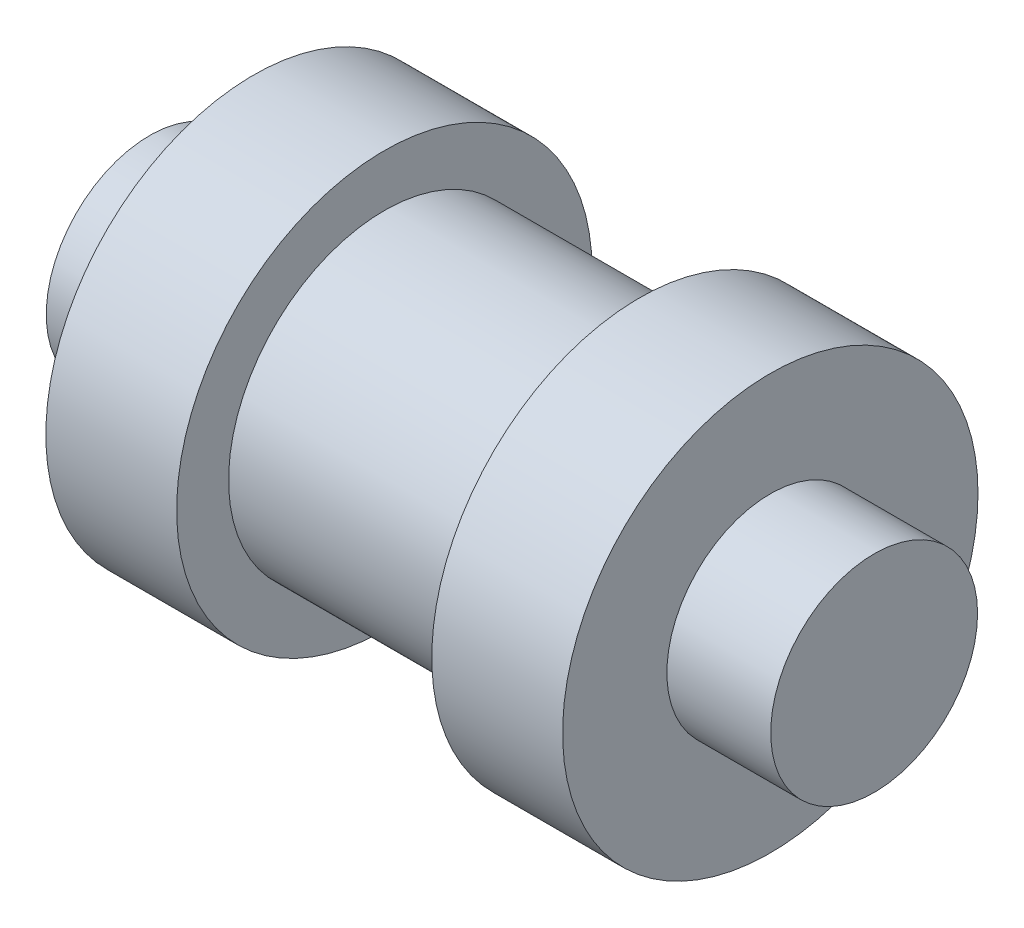
ISO-10303-21;
HEADER;
FILE_DESCRIPTION(('STEP AP214'),'2;1');
FILE_NAME('part.step','',(''),(''),'','','');
FILE_SCHEMA(('AUTOMOTIVE_DESIGN { 1 0 10303 214 1 1 1 1 }'));
ENDSEC;
DATA;
#1=APPLICATION_CONTEXT('core data for automotive mechanical design processes');
#2=APPLICATION_PROTOCOL_DEFINITION('international standard','automotive_design',2000,#1);
#3=PRODUCT_CONTEXT('',#1,'mechanical');
#4=PRODUCT('Part','Part','',(#3));
#5=PRODUCT_RELATED_PRODUCT_CATEGORY('part','',(#4));
#6=PRODUCT_DEFINITION_FORMATION('','',#4);
#7=PRODUCT_DEFINITION_CONTEXT('part definition',#1,'design');
#8=PRODUCT_DEFINITION('design','',#6,#7);
#9=PRODUCT_DEFINITION_SHAPE('','',#8);
#10=(LENGTH_UNIT() NAMED_UNIT(*) SI_UNIT(.MILLI.,.METRE.));
#11=(NAMED_UNIT(*) PLANE_ANGLE_UNIT() SI_UNIT($,.RADIAN.));
#12=(NAMED_UNIT(*) SI_UNIT($,.STERADIAN.) SOLID_ANGLE_UNIT());
#13=UNCERTAINTY_MEASURE_WITH_UNIT(LENGTH_MEASURE(1.E-05),#10,'distance_accuracy_value','');
#14=(GEOMETRIC_REPRESENTATION_CONTEXT(3) GLOBAL_UNCERTAINTY_ASSIGNED_CONTEXT((#13)) GLOBAL_UNIT_ASSIGNED_CONTEXT((#10,
#11,#12)) REPRESENTATION_CONTEXT('',''));
#15=CARTESIAN_POINT('',(0.,0.,0.));
#16=DIRECTION('',(0.,0.,1.));
#17=DIRECTION('',(1.,0.,0.));
#18=AXIS2_PLACEMENT_3D('',#15,#16,#17);
#19=CARTESIAN_POINT('',(-5.5375,0.,0.));
#20=DIRECTION('',(-1.,0.,0.));
#21=DIRECTION('',(0.,0.,1.));
#22=AXIS2_PLACEMENT_3D('',#19,#20,#21);
#23=PLANE('',#22);
#24=CARTESIAN_POINT('',(-5.5375,0.,0.));
#25=DIRECTION('',(1.,0.,0.));
#26=DIRECTION('',(0.,0.,-1.));
#27=AXIS2_PLACEMENT_3D('',#24,#25,#26);
#28=CIRCLE('',#27,1.58115);
#29=CARTESIAN_POINT('',(-5.5375,0.,-1.58115));
#30=VERTEX_POINT('',#29);
#31=EDGE_CURVE('E10',#30,#30,#28,.T.);
#32=ORIENTED_EDGE('',*,*,#31,.F.);
#33=EDGE_LOOP('',(#32));
#34=FACE_BOUND('',#33,.T.);
#35=ADVANCED_FACE('F30',(#34),#23,.T.);
#36=CARTESIAN_POINT('',(11.7976766212602,0.,0.));
#37=DIRECTION('',(1.,0.,0.));
#38=DIRECTION('',(0.,0.,-1.));
#39=AXIS2_PLACEMENT_3D('',#36,#37,#38);
#40=CYLINDRICAL_SURFACE('',#39,1.58115);
#41=ORIENTED_EDGE('',*,*,#31,.T.);
#42=EDGE_LOOP('',(#41));
#43=FACE_BOUND('',#42,.T.);
#44=CARTESIAN_POINT('',(-3.95,0.,0.));
#45=DIRECTION('',(1.,0.,0.));
#46=DIRECTION('',(0.,0.,-1.));
#47=AXIS2_PLACEMENT_3D('',#44,#45,#46);
#48=CIRCLE('',#47,1.58115);
#49=CARTESIAN_POINT('',(-3.95,0.,-1.58115));
#50=VERTEX_POINT('',#49);
#51=EDGE_CURVE('E36',#50,#50,#48,.T.);
#52=ORIENTED_EDGE('',*,*,#51,.F.);
#53=EDGE_LOOP('',(#52));
#54=FACE_BOUND('',#53,.T.);
#55=ADVANCED_FACE('F84',(#43,#54),#40,.T.);
#56=CARTESIAN_POINT('',(-3.95,1.58115,0.));
#57=DIRECTION('',(-1.,0.,0.));
#58=DIRECTION('',(0.,0.,1.));
#59=AXIS2_PLACEMENT_3D('',#56,#57,#58);
#60=PLANE('',#59);
#61=ORIENTED_EDGE('',*,*,#51,.T.);
#62=EDGE_LOOP('',(#61));
#63=FACE_BOUND('',#62,.T.);
#64=CARTESIAN_POINT('',(-3.95,0.,0.));
#65=DIRECTION('',(1.,0.,0.));
#66=DIRECTION('',(0.,0.,-1.));
#67=AXIS2_PLACEMENT_3D('',#64,#65,#66);
#68=CIRCLE('',#67,3.175);
#69=CARTESIAN_POINT('',(-3.95,0.,-3.175));
#70=VERTEX_POINT('',#69);
#71=EDGE_CURVE('E40',#70,#70,#68,.T.);
#72=ORIENTED_EDGE('',*,*,#71,.F.);
#73=EDGE_LOOP('',(#72));
#74=FACE_BOUND('',#73,.T.);
#75=ADVANCED_FACE('F89',(#63,#74),#60,.T.);
#76=CARTESIAN_POINT('',(11.7976766212602,0.,0.));
#77=DIRECTION('',(1.,0.,0.));
#78=DIRECTION('',(0.,0.,-1.));
#79=AXIS2_PLACEMENT_3D('',#76,#77,#78);
#80=CYLINDRICAL_SURFACE('',#79,3.175);
#81=ORIENTED_EDGE('',*,*,#71,.T.);
#82=EDGE_LOOP('',(#81));
#83=FACE_BOUND('',#82,.T.);
#84=CARTESIAN_POINT('',(-1.95,0.,0.));
#85=DIRECTION('',(1.,0.,0.));
#86=DIRECTION('',(0.,0.,-1.));
#87=AXIS2_PLACEMENT_3D('',#84,#85,#86);
#88=CIRCLE('',#87,3.175);
#89=CARTESIAN_POINT('',(-1.95,0.,-3.175));
#90=VERTEX_POINT('',#89);
#91=EDGE_CURVE('E44',#90,#90,#88,.T.);
#92=ORIENTED_EDGE('',*,*,#91,.F.);
#93=EDGE_LOOP('',(#92));
#94=FACE_BOUND('',#93,.T.);
#95=ADVANCED_FACE('F93',(#83,#94),#80,.T.);
#96=CARTESIAN_POINT('',(-1.95,3.175,0.));
#97=DIRECTION('',(1.,0.,0.));
#98=DIRECTION('',(0.,0.,-1.));
#99=AXIS2_PLACEMENT_3D('',#96,#97,#98);
#100=PLANE('',#99);
#101=ORIENTED_EDGE('',*,*,#91,.T.);
#102=EDGE_LOOP('',(#101));
#103=FACE_BOUND('',#102,.T.);
#104=CARTESIAN_POINT('',(-1.95,0.,0.));
#105=DIRECTION('',(1.,0.,0.));
#106=DIRECTION('',(0.,0.,-1.));
#107=AXIS2_PLACEMENT_3D('',#104,#105,#106);
#108=CIRCLE('',#107,2.38125);
#109=CARTESIAN_POINT('',(-1.95,0.,-2.38125));
#110=VERTEX_POINT('',#109);
#111=EDGE_CURVE('E49',#110,#110,#108,.T.);
#112=ORIENTED_EDGE('',*,*,#111,.F.);
#113=EDGE_LOOP('',(#112));
#114=FACE_BOUND('',#113,.T.);
#115=ADVANCED_FACE('F99',(#103,#114),#100,.T.);
#116=CARTESIAN_POINT('',(11.7976766212602,0.,0.));
#117=DIRECTION('',(1.,0.,0.));
#118=DIRECTION('',(0.,0.,-1.));
#119=AXIS2_PLACEMENT_3D('',#116,#117,#118);
#120=CYLINDRICAL_SURFACE('',#119,2.38125);
#121=ORIENTED_EDGE('',*,*,#111,.T.);
#122=EDGE_LOOP('',(#121));
#123=FACE_BOUND('',#122,.T.);
#124=CARTESIAN_POINT('',(1.95,0.,0.));
#125=DIRECTION('',(1.,0.,0.));
#126=DIRECTION('',(0.,0.,-1.));
#127=AXIS2_PLACEMENT_3D('',#124,#125,#126);
#128=CIRCLE('',#127,2.38125);
#129=CARTESIAN_POINT('',(1.95,0.,-2.38125));
#130=VERTEX_POINT('',#129);
#131=EDGE_CURVE('E52',#130,#130,#128,.T.);
#132=ORIENTED_EDGE('',*,*,#131,.F.);
#133=EDGE_LOOP('',(#132));
#134=FACE_BOUND('',#133,.T.);
#135=ADVANCED_FACE('F103',(#123,#134),#120,.T.);
#136=CARTESIAN_POINT('',(1.95,3.175,0.));
#137=DIRECTION('',(-1.,0.,0.));
#138=DIRECTION('',(0.,0.,1.));
#139=AXIS2_PLACEMENT_3D('',#136,#137,#138);
#140=PLANE('',#139);
#141=ORIENTED_EDGE('',*,*,#131,.T.);
#142=EDGE_LOOP('',(#141));
#143=FACE_BOUND('',#142,.T.);
#144=CARTESIAN_POINT('',(1.95,0.,0.));
#145=DIRECTION('',(1.,0.,0.));
#146=DIRECTION('',(0.,0.,-1.));
#147=AXIS2_PLACEMENT_3D('',#144,#145,#146);
#148=CIRCLE('',#147,3.175);
#149=CARTESIAN_POINT('',(1.95,0.,-3.175));
#150=VERTEX_POINT('',#149);
#151=EDGE_CURVE('E55',#150,#150,#148,.T.);
#152=ORIENTED_EDGE('',*,*,#151,.F.);
#153=EDGE_LOOP('',(#152));
#154=FACE_BOUND('',#153,.T.);
#155=ADVANCED_FACE('F107',(#143,#154),#140,.T.);
#156=CARTESIAN_POINT('',(11.7976766212602,0.,0.));
#157=DIRECTION('',(1.,0.,0.));
#158=DIRECTION('',(0.,0.,-1.));
#159=AXIS2_PLACEMENT_3D('',#156,#157,#158);
#160=CYLINDRICAL_SURFACE('',#159,3.175);
#161=ORIENTED_EDGE('',*,*,#151,.T.);
#162=EDGE_LOOP('',(#161));
#163=FACE_BOUND('',#162,.T.);
#164=CARTESIAN_POINT('',(3.95,0.,0.));
#165=DIRECTION('',(1.,0.,0.));
#166=DIRECTION('',(0.,0.,-1.));
#167=AXIS2_PLACEMENT_3D('',#164,#165,#166);
#168=CIRCLE('',#167,3.175);
#169=CARTESIAN_POINT('',(3.95,0.,-3.175));
#170=VERTEX_POINT('',#169);
#171=EDGE_CURVE('E58',#170,#170,#168,.T.);
#172=ORIENTED_EDGE('',*,*,#171,.F.);
#173=EDGE_LOOP('',(#172));
#174=FACE_BOUND('',#173,.T.);
#175=ADVANCED_FACE('F80',(#163,#174),#160,.T.);
#176=CARTESIAN_POINT('',(3.95,1.58115,0.));
#177=DIRECTION('',(1.,0.,0.));
#178=DIRECTION('',(0.,0.,-1.));
#179=AXIS2_PLACEMENT_3D('',#176,#177,#178);
#180=PLANE('',#179);
#181=ORIENTED_EDGE('',*,*,#171,.T.);
#182=EDGE_LOOP('',(#181));
#183=FACE_BOUND('',#182,.T.);
#184=CARTESIAN_POINT('',(3.95,0.,0.));
#185=DIRECTION('',(1.,0.,0.));
#186=DIRECTION('',(0.,0.,-1.));
#187=AXIS2_PLACEMENT_3D('',#184,#185,#186);
#188=CIRCLE('',#187,1.58115);
#189=CARTESIAN_POINT('',(3.95,0.,-1.58115));
#190=VERTEX_POINT('',#189);
#191=EDGE_CURVE('E61',#190,#190,#188,.T.);
#192=ORIENTED_EDGE('',*,*,#191,.F.);
#193=EDGE_LOOP('',(#192));
#194=FACE_BOUND('',#193,.T.);
#195=ADVANCED_FACE('F72',(#183,#194),#180,.T.);
#196=CARTESIAN_POINT('',(11.7976766212602,0.,0.));
#197=DIRECTION('',(1.,0.,0.));
#198=DIRECTION('',(0.,0.,-1.));
#199=AXIS2_PLACEMENT_3D('',#196,#197,#198);
#200=CYLINDRICAL_SURFACE('',#199,1.58115);
#201=ORIENTED_EDGE('',*,*,#191,.T.);
#202=EDGE_LOOP('',(#201));
#203=FACE_BOUND('',#202,.T.);
#204=CARTESIAN_POINT('',(5.5375,0.,0.));
#205=DIRECTION('',(1.,0.,0.));
#206=DIRECTION('',(0.,0.,-1.));
#207=AXIS2_PLACEMENT_3D('',#204,#205,#206);
#208=CIRCLE('',#207,1.58115);
#209=CARTESIAN_POINT('',(5.5375,0.,-1.58115));
#210=VERTEX_POINT('',#209);
#211=EDGE_CURVE('E64',#210,#210,#208,.T.);
#212=ORIENTED_EDGE('',*,*,#211,.F.);
#213=EDGE_LOOP('',(#212));
#214=FACE_BOUND('',#213,.T.);
#215=ADVANCED_FACE('F70',(#203,#214),#200,.T.);
#216=CARTESIAN_POINT('',(5.5375,0.,0.));
#217=DIRECTION('',(1.,0.,0.));
#218=DIRECTION('',(0.,0.,-1.));
#219=AXIS2_PLACEMENT_3D('',#216,#217,#218);
#220=PLANE('',#219);
#221=ORIENTED_EDGE('',*,*,#211,.T.);
#222=EDGE_LOOP('',(#221));
#223=FACE_BOUND('',#222,.T.);
#224=ADVANCED_FACE('F68',(#223),#220,.T.);
#225=CLOSED_SHELL('',(#35,#55,#75,#95,#115,#135,#155,#175,#195,#215,#224));
#226=MANIFOLD_SOLID_BREP('B2',#225);
#227=ADVANCED_BREP_SHAPE_REPRESENTATION('',(#18,#226),#14);
#228=SHAPE_DEFINITION_REPRESENTATION(#9,#227);
ENDSEC;
END-ISO-10303-21;
